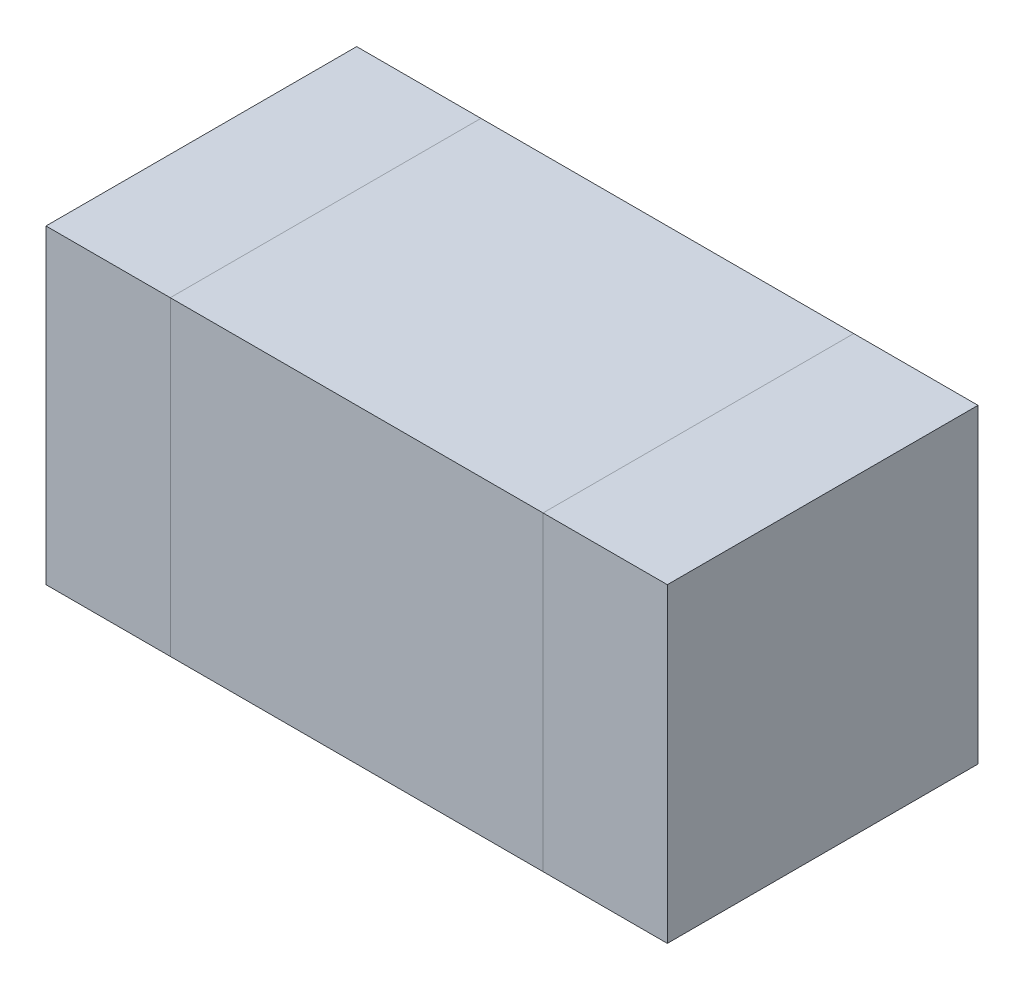
ISO-10303-21;
HEADER;
FILE_DESCRIPTION(('STEP AP214'),'2;1');
FILE_NAME('part.step','',(''),(''),'','','');
FILE_SCHEMA(('AUTOMOTIVE_DESIGN { 1 0 10303 214 1 1 1 1 }'));
ENDSEC;
DATA;
#1=APPLICATION_CONTEXT('core data for automotive mechanical design processes');
#2=APPLICATION_PROTOCOL_DEFINITION('international standard','automotive_design',2000,#1);
#3=PRODUCT_CONTEXT('',#1,'mechanical');
#4=PRODUCT('Part','Part','',(#3));
#5=PRODUCT_RELATED_PRODUCT_CATEGORY('part','',(#4));
#6=PRODUCT_DEFINITION_FORMATION('','',#4);
#7=PRODUCT_DEFINITION_CONTEXT('part definition',#1,'design');
#8=PRODUCT_DEFINITION('design','',#6,#7);
#9=PRODUCT_DEFINITION_SHAPE('','',#8);
#10=(LENGTH_UNIT() NAMED_UNIT(*) SI_UNIT(.MILLI.,.METRE.));
#11=(NAMED_UNIT(*) PLANE_ANGLE_UNIT() SI_UNIT($,.RADIAN.));
#12=(NAMED_UNIT(*) SI_UNIT($,.STERADIAN.) SOLID_ANGLE_UNIT());
#13=UNCERTAINTY_MEASURE_WITH_UNIT(LENGTH_MEASURE(1.E-05),#10,'distance_accuracy_value','');
#14=(GEOMETRIC_REPRESENTATION_CONTEXT(3) GLOBAL_UNCERTAINTY_ASSIGNED_CONTEXT((#13)) GLOBAL_UNIT_ASSIGNED_CONTEXT((#10,
#11,#12)) REPRESENTATION_CONTEXT('',''));
#15=CARTESIAN_POINT('',(0.,0.,0.));
#16=DIRECTION('',(0.,0.,1.));
#17=DIRECTION('',(1.,0.,0.));
#18=AXIS2_PLACEMENT_3D('',#15,#16,#17);
#19=CARTESIAN_POINT('',(-0.3,0.5,0.));
#20=DIRECTION('',(1.,0.,0.));
#21=DIRECTION('',(0.,0.,-1.));
#22=AXIS2_PLACEMENT_3D('',#19,#20,#21);
#23=PLANE('',#22);
#24=DIRECTION('',(0.,0.,1.));
#25=VECTOR('',#24,1.);
#26=CARTESIAN_POINT('',(-0.3,0.5,0.));
#27=LINE('',#26,#25);
#28=CARTESIAN_POINT('',(-0.3,0.5,0.25));
#29=VERTEX_POINT('',#28);
#30=CARTESIAN_POINT('',(-0.3,0.5,-0.25));
#31=VERTEX_POINT('',#30);
#32=EDGE_CURVE('P0_E58',#29,#31,#27,.F.);
#33=ORIENTED_EDGE('',*,*,#32,.F.);
#34=DIRECTION('',(0.,1.,0.));
#35=VECTOR('',#34,1.);
#36=CARTESIAN_POINT('',(-0.3,0.5,0.25));
#37=LINE('',#36,#35);
#38=CARTESIAN_POINT('',(-0.3,0.,0.25));
#39=VERTEX_POINT('',#38);
#40=EDGE_CURVE('P0_E52',#39,#29,#37,.T.);
#41=ORIENTED_EDGE('',*,*,#40,.F.);
#42=DIRECTION('',(0.,0.,1.));
#43=VECTOR('',#42,1.);
#44=CARTESIAN_POINT('',(-0.3,0.,0.));
#45=LINE('',#44,#43);
#46=CARTESIAN_POINT('',(-0.3,0.,-0.25));
#47=VERTEX_POINT('',#46);
#48=EDGE_CURVE('P0_E60',#39,#47,#45,.F.);
#49=ORIENTED_EDGE('',*,*,#48,.T.);
#50=DIRECTION('',(0.,1.,0.));
#51=VECTOR('',#50,1.);
#52=CARTESIAN_POINT('',(-0.3,0.5,-0.25));
#53=LINE('',#52,#51);
#54=EDGE_CURVE('P0_E19',#47,#31,#53,.T.);
#55=ORIENTED_EDGE('',*,*,#54,.T.);
#56=EDGE_LOOP('',(#33,#41,#49,#55));
#57=FACE_BOUND('',#56,.T.);
#58=ADVANCED_FACE('P0_F16',(#57),#23,.T.);
#59=CARTESIAN_POINT('',(0.,0.5,-0.25));
#60=DIRECTION('',(0.,0.,1.));
#61=DIRECTION('',(1.,0.,0.));
#62=AXIS2_PLACEMENT_3D('',#59,#60,#61);
#63=PLANE('',#62);
#64=DIRECTION('',(0.,1.,0.));
#65=VECTOR('',#64,1.);
#66=CARTESIAN_POINT('',(-0.5,0.5,-0.25));
#67=LINE('',#66,#65);
#68=CARTESIAN_POINT('',(-0.5,0.,-0.25));
#69=VERTEX_POINT('',#68);
#70=CARTESIAN_POINT('',(-0.5,0.5,-0.25));
#71=VERTEX_POINT('',#70);
#72=EDGE_CURVE('P0_E74',#69,#71,#67,.T.);
#73=ORIENTED_EDGE('',*,*,#72,.T.);
#74=DIRECTION('',(1.,0.,0.));
#75=VECTOR('',#74,1.);
#76=CARTESIAN_POINT('',(0.,0.5,-0.25));
#77=LINE('',#76,#75);
#78=EDGE_CURVE('P0_E65',#31,#71,#77,.F.);
#79=ORIENTED_EDGE('',*,*,#78,.F.);
#80=ORIENTED_EDGE('',*,*,#54,.F.);
#81=DIRECTION('',(1.,0.,0.));
#82=VECTOR('',#81,1.);
#83=CARTESIAN_POINT('',(0.,0.,-0.25));
#84=LINE('',#83,#82);
#85=EDGE_CURVE('P0_E80',#47,#69,#84,.F.);
#86=ORIENTED_EDGE('',*,*,#85,.T.);
#87=EDGE_LOOP('',(#73,#79,#80,#86));
#88=FACE_BOUND('',#87,.T.);
#89=ADVANCED_FACE('P0_F73',(#88),#63,.F.);
#90=CARTESIAN_POINT('',(0.,0.5,0.));
#91=DIRECTION('',(0.,1.,0.));
#92=DIRECTION('',(0.,0.,1.));
#93=AXIS2_PLACEMENT_3D('',#90,#91,#92);
#94=PLANE('',#93);
#95=DIRECTION('',(1.,0.,0.));
#96=VECTOR('',#95,1.);
#97=CARTESIAN_POINT('',(0.,0.5,0.25));
#98=LINE('',#97,#96);
#99=CARTESIAN_POINT('',(-0.5,0.5,0.25));
#100=VERTEX_POINT('',#99);
#101=EDGE_CURVE('P0_E70',#29,#100,#98,.F.);
#102=ORIENTED_EDGE('',*,*,#101,.F.);
#103=ORIENTED_EDGE('',*,*,#32,.T.);
#104=ORIENTED_EDGE('',*,*,#78,.T.);
#105=DIRECTION('',(0.,0.,-1.));
#106=VECTOR('',#105,1.);
#107=CARTESIAN_POINT('',(-0.5,0.5,0.));
#108=LINE('',#107,#106);
#109=EDGE_CURVE('P0_E83',#71,#100,#108,.F.);
#110=ORIENTED_EDGE('',*,*,#109,.T.);
#111=EDGE_LOOP('',(#102,#103,#104,#110));
#112=FACE_BOUND('',#111,.T.);
#113=ADVANCED_FACE('P0_F67',(#112),#94,.T.);
#114=CARTESIAN_POINT('',(0.,0.5,0.25));
#115=DIRECTION('',(0.,0.,1.));
#116=DIRECTION('',(1.,0.,0.));
#117=AXIS2_PLACEMENT_3D('',#114,#115,#116);
#118=PLANE('',#117);
#119=ORIENTED_EDGE('',*,*,#101,.T.);
#120=DIRECTION('',(0.,1.,0.));
#121=VECTOR('',#120,1.);
#122=CARTESIAN_POINT('',(-0.5,0.5,0.25));
#123=LINE('',#122,#121);
#124=CARTESIAN_POINT('',(-0.5,0.,0.25));
#125=VERTEX_POINT('',#124);
#126=EDGE_CURVE('P0_E25',#100,#125,#123,.F.);
#127=ORIENTED_EDGE('',*,*,#126,.T.);
#128=DIRECTION('',(1.,0.,0.));
#129=VECTOR('',#128,1.);
#130=CARTESIAN_POINT('',(0.,0.,0.25));
#131=LINE('',#130,#129);
#132=EDGE_CURVE('P0_E33',#125,#39,#131,.T.);
#133=ORIENTED_EDGE('',*,*,#132,.T.);
#134=ORIENTED_EDGE('',*,*,#40,.T.);
#135=EDGE_LOOP('',(#119,#127,#133,#134));
#136=FACE_BOUND('',#135,.T.);
#137=ADVANCED_FACE('P0_F87',(#136),#118,.T.);
#138=CARTESIAN_POINT('',(0.,0.,0.));
#139=DIRECTION('',(0.,1.,0.));
#140=DIRECTION('',(0.,0.,1.));
#141=AXIS2_PLACEMENT_3D('',#138,#139,#140);
#142=PLANE('',#141);
#143=ORIENTED_EDGE('',*,*,#48,.F.);
#144=ORIENTED_EDGE('',*,*,#132,.F.);
#145=DIRECTION('',(0.,0.,-1.));
#146=VECTOR('',#145,1.);
#147=CARTESIAN_POINT('',(-0.5,0.,0.));
#148=LINE('',#147,#146);
#149=EDGE_CURVE('P0_E11',#125,#69,#148,.T.);
#150=ORIENTED_EDGE('',*,*,#149,.T.);
#151=ORIENTED_EDGE('',*,*,#85,.F.);
#152=EDGE_LOOP('',(#143,#144,#150,#151));
#153=FACE_BOUND('',#152,.T.);
#154=ADVANCED_FACE('P0_F90',(#153),#142,.F.);
#155=CARTESIAN_POINT('',(-0.5,0.5,0.));
#156=DIRECTION('',(1.,0.,0.));
#157=DIRECTION('',(0.,0.,-1.));
#158=AXIS2_PLACEMENT_3D('',#155,#156,#157);
#159=PLANE('',#158);
#160=ORIENTED_EDGE('',*,*,#126,.F.);
#161=ORIENTED_EDGE('',*,*,#109,.F.);
#162=ORIENTED_EDGE('',*,*,#72,.F.);
#163=ORIENTED_EDGE('',*,*,#149,.F.);
#164=EDGE_LOOP('',(#160,#161,#162,#163));
#165=FACE_BOUND('',#164,.T.);
#166=ADVANCED_FACE('P0_F89',(#165),#159,.F.);
#167=CLOSED_SHELL('',(#58,#89,#113,#137,#154,#166));
#168=MANIFOLD_SOLID_BREP('P0_B1',#167);
#169=CARTESIAN_POINT('',(0.,0.5,-0.25));
#170=DIRECTION('',(0.,0.,-1.));
#171=DIRECTION('',(-1.,0.,0.));
#172=AXIS2_PLACEMENT_3D('',#169,#170,#171);
#173=PLANE('',#172);
#174=DIRECTION('',(1.,0.,0.));
#175=VECTOR('',#174,1.);
#176=CARTESIAN_POINT('',(0.,0.5,-0.25));
#177=LINE('',#176,#175);
#178=CARTESIAN_POINT('',(0.3,0.5,-0.25));
#179=VERTEX_POINT('',#178);
#180=CARTESIAN_POINT('',(-0.3,0.5,-0.25));
#181=VERTEX_POINT('',#180);
#182=EDGE_CURVE('P1_E57',#179,#181,#177,.F.);
#183=ORIENTED_EDGE('',*,*,#182,.F.);
#184=DIRECTION('',(0.,1.,0.));
#185=VECTOR('',#184,1.);
#186=CARTESIAN_POINT('',(0.3,0.5,-0.25));
#187=LINE('',#186,#185);
#188=CARTESIAN_POINT('',(0.3,0.,-0.25));
#189=VERTEX_POINT('',#188);
#190=EDGE_CURVE('P1_E52',#189,#179,#187,.T.);
#191=ORIENTED_EDGE('',*,*,#190,.F.);
#192=DIRECTION('',(1.,0.,0.));
#193=VECTOR('',#192,1.);
#194=CARTESIAN_POINT('',(0.,0.,-0.25));
#195=LINE('',#194,#193);
#196=CARTESIAN_POINT('',(-0.3,0.,-0.25));
#197=VERTEX_POINT('',#196);
#198=EDGE_CURVE('P1_E67',#189,#197,#195,.F.);
#199=ORIENTED_EDGE('',*,*,#198,.T.);
#200=DIRECTION('',(0.,1.,0.));
#201=VECTOR('',#200,1.);
#202=CARTESIAN_POINT('',(-0.3,0.5,-0.25));
#203=LINE('',#202,#201);
#204=EDGE_CURVE('P1_E19',#197,#181,#203,.T.);
#205=ORIENTED_EDGE('',*,*,#204,.T.);
#206=EDGE_LOOP('',(#183,#191,#199,#205));
#207=FACE_BOUND('',#206,.T.);
#208=ADVANCED_FACE('P1_F16',(#207),#173,.T.);
#209=CARTESIAN_POINT('',(-0.3,0.5,0.));
#210=DIRECTION('',(1.,0.,0.));
#211=DIRECTION('',(0.,0.,-1.));
#212=AXIS2_PLACEMENT_3D('',#209,#210,#211);
#213=PLANE('',#212);
#214=DIRECTION('',(0.,1.,0.));
#215=VECTOR('',#214,1.);
#216=CARTESIAN_POINT('',(-0.3,0.5,0.25));
#217=LINE('',#216,#215);
#218=CARTESIAN_POINT('',(-0.3,0.,0.25));
#219=VERTEX_POINT('',#218);
#220=CARTESIAN_POINT('',(-0.3,0.5,0.25));
#221=VERTEX_POINT('',#220);
#222=EDGE_CURVE('P1_E73',#219,#221,#217,.T.);
#223=ORIENTED_EDGE('',*,*,#222,.T.);
#224=DIRECTION('',(0.,0.,1.));
#225=VECTOR('',#224,1.);
#226=CARTESIAN_POINT('',(-0.3,0.5,0.));
#227=LINE('',#226,#225);
#228=EDGE_CURVE('P1_E62',#181,#221,#227,.T.);
#229=ORIENTED_EDGE('',*,*,#228,.F.);
#230=ORIENTED_EDGE('',*,*,#204,.F.);
#231=DIRECTION('',(0.,0.,1.));
#232=VECTOR('',#231,1.);
#233=CARTESIAN_POINT('',(-0.3,0.,0.));
#234=LINE('',#233,#232);
#235=EDGE_CURVE('P1_E80',#197,#219,#234,.T.);
#236=ORIENTED_EDGE('',*,*,#235,.T.);
#237=EDGE_LOOP('',(#223,#229,#230,#236));
#238=FACE_BOUND('',#237,.T.);
#239=ADVANCED_FACE('P1_F72',(#238),#213,.F.);
#240=CARTESIAN_POINT('',(0.,0.5,0.));
#241=DIRECTION('',(0.,1.,0.));
#242=DIRECTION('',(0.,0.,1.));
#243=AXIS2_PLACEMENT_3D('',#240,#241,#242);
#244=PLANE('',#243);
#245=ORIENTED_EDGE('',*,*,#182,.T.);
#246=ORIENTED_EDGE('',*,*,#228,.T.);
#247=DIRECTION('',(-1.,0.,0.));
#248=VECTOR('',#247,1.);
#249=CARTESIAN_POINT('',(0.,0.5,0.25));
#250=LINE('',#249,#248);
#251=CARTESIAN_POINT('',(0.3,0.5,0.25));
#252=VERTEX_POINT('',#251);
#253=EDGE_CURVE('P1_E83',#221,#252,#250,.F.);
#254=ORIENTED_EDGE('',*,*,#253,.T.);
#255=DIRECTION('',(0.,0.,-1.));
#256=VECTOR('',#255,1.);
#257=CARTESIAN_POINT('',(0.3,0.5,0.));
#258=LINE('',#257,#256);
#259=EDGE_CURVE('P1_E64',#179,#252,#258,.F.);
#260=ORIENTED_EDGE('',*,*,#259,.F.);
#261=EDGE_LOOP('',(#245,#246,#254,#260));
#262=FACE_BOUND('',#261,.T.);
#263=ADVANCED_FACE('P1_F59',(#262),#244,.T.);
#264=CARTESIAN_POINT('',(0.3,0.5,0.));
#265=DIRECTION('',(1.,0.,0.));
#266=DIRECTION('',(0.,0.,-1.));
#267=AXIS2_PLACEMENT_3D('',#264,#265,#266);
#268=PLANE('',#267);
#269=ORIENTED_EDGE('',*,*,#259,.T.);
#270=DIRECTION('',(0.,1.,0.));
#271=VECTOR('',#270,1.);
#272=CARTESIAN_POINT('',(0.3,0.5,0.25));
#273=LINE('',#272,#271);
#274=CARTESIAN_POINT('',(0.3,0.,0.25));
#275=VERTEX_POINT('',#274);
#276=EDGE_CURVE('P1_E25',#252,#275,#273,.F.);
#277=ORIENTED_EDGE('',*,*,#276,.T.);
#278=DIRECTION('',(0.,0.,1.));
#279=VECTOR('',#278,1.);
#280=CARTESIAN_POINT('',(0.3,0.,0.));
#281=LINE('',#280,#279);
#282=EDGE_CURVE('P1_E33',#275,#189,#281,.F.);
#283=ORIENTED_EDGE('',*,*,#282,.T.);
#284=ORIENTED_EDGE('',*,*,#190,.T.);
#285=EDGE_LOOP('',(#269,#277,#283,#284));
#286=FACE_BOUND('',#285,.T.);
#287=ADVANCED_FACE('P1_F87',(#286),#268,.T.);
#288=CARTESIAN_POINT('',(0.,0.,0.));
#289=DIRECTION('',(0.,1.,0.));
#290=DIRECTION('',(0.,0.,1.));
#291=AXIS2_PLACEMENT_3D('',#288,#289,#290);
#292=PLANE('',#291);
#293=ORIENTED_EDGE('',*,*,#235,.F.);
#294=ORIENTED_EDGE('',*,*,#198,.F.);
#295=ORIENTED_EDGE('',*,*,#282,.F.);
#296=DIRECTION('',(-1.,0.,0.));
#297=VECTOR('',#296,1.);
#298=CARTESIAN_POINT('',(0.,0.,0.25));
#299=LINE('',#298,#297);
#300=EDGE_CURVE('P1_E11',#275,#219,#299,.T.);
#301=ORIENTED_EDGE('',*,*,#300,.T.);
#302=EDGE_LOOP('',(#293,#294,#295,#301));
#303=FACE_BOUND('',#302,.T.);
#304=ADVANCED_FACE('P1_F90',(#303),#292,.F.);
#305=CARTESIAN_POINT('',(0.,0.5,0.25));
#306=DIRECTION('',(0.,0.,-1.));
#307=DIRECTION('',(-1.,0.,0.));
#308=AXIS2_PLACEMENT_3D('',#305,#306,#307);
#309=PLANE('',#308);
#310=ORIENTED_EDGE('',*,*,#276,.F.);
#311=ORIENTED_EDGE('',*,*,#253,.F.);
#312=ORIENTED_EDGE('',*,*,#222,.F.);
#313=ORIENTED_EDGE('',*,*,#300,.F.);
#314=EDGE_LOOP('',(#310,#311,#312,#313));
#315=FACE_BOUND('',#314,.T.);
#316=ADVANCED_FACE('P1_F89',(#315),#309,.F.);
#317=CLOSED_SHELL('',(#208,#239,#263,#287,#304,#316));
#318=MANIFOLD_SOLID_BREP('P1_B1',#317);
#319=CARTESIAN_POINT('',(0.3,0.5,0.));
#320=DIRECTION('',(1.,0.,0.));
#321=DIRECTION('',(0.,0.,-1.));
#322=AXIS2_PLACEMENT_3D('',#319,#320,#321);
#323=PLANE('',#322);
#324=DIRECTION('',(0.,1.,0.));
#325=VECTOR('',#324,1.);
#326=CARTESIAN_POINT('',(0.3,0.5,0.25));
#327=LINE('',#326,#325);
#328=CARTESIAN_POINT('',(0.3,0.,0.25));
#329=VERTEX_POINT('',#328);
#330=CARTESIAN_POINT('',(0.3,0.5,0.25));
#331=VERTEX_POINT('',#330);
#332=EDGE_CURVE('P2_E78',#329,#331,#327,.T.);
#333=ORIENTED_EDGE('',*,*,#332,.T.);
#334=DIRECTION('',(0.,0.,1.));
#335=VECTOR('',#334,1.);
#336=CARTESIAN_POINT('',(0.3,0.5,0.));
#337=LINE('',#336,#335);
#338=CARTESIAN_POINT('',(0.3,0.5,-0.25));
#339=VERTEX_POINT('',#338);
#340=EDGE_CURVE('P2_E67',#339,#331,#337,.T.);
#341=ORIENTED_EDGE('',*,*,#340,.F.);
#342=DIRECTION('',(0.,1.,0.));
#343=VECTOR('',#342,1.);
#344=CARTESIAN_POINT('',(0.3,0.5,-0.25));
#345=LINE('',#344,#343);
#346=CARTESIAN_POINT('',(0.3,0.,-0.25));
#347=VERTEX_POINT('',#346);
#348=EDGE_CURVE('P2_E55',#347,#339,#345,.T.);
#349=ORIENTED_EDGE('',*,*,#348,.F.);
#350=DIRECTION('',(0.,0.,1.));
#351=VECTOR('',#350,1.);
#352=CARTESIAN_POINT('',(0.3,0.,0.));
#353=LINE('',#352,#351);
#354=EDGE_CURVE('P2_E19',#347,#329,#353,.T.);
#355=ORIENTED_EDGE('',*,*,#354,.T.);
#356=EDGE_LOOP('',(#333,#341,#349,#355));
#357=FACE_BOUND('',#356,.T.);
#358=ADVANCED_FACE('P2_F16',(#357),#323,.F.);
#359=CARTESIAN_POINT('',(0.,0.,0.));
#360=DIRECTION('',(0.,1.,0.));
#361=DIRECTION('',(0.,0.,1.));
#362=AXIS2_PLACEMENT_3D('',#359,#360,#361);
#363=PLANE('',#362);
#364=DIRECTION('',(-1.,0.,0.));
#365=VECTOR('',#364,1.);
#366=CARTESIAN_POINT('',(0.,0.,0.25));
#367=LINE('',#366,#365);
#368=CARTESIAN_POINT('',(0.5,0.,0.25));
#369=VERTEX_POINT('',#368);
#370=EDGE_CURVE('P2_E64',#369,#329,#367,.T.);
#371=ORIENTED_EDGE('',*,*,#370,.T.);
#372=ORIENTED_EDGE('',*,*,#354,.F.);
#373=DIRECTION('',(-1.,0.,0.));
#374=VECTOR('',#373,1.);
#375=CARTESIAN_POINT('',(0.,0.,-0.25));
#376=LINE('',#375,#374);
#377=CARTESIAN_POINT('',(0.5,0.,-0.25));
#378=VERTEX_POINT('',#377);
#379=EDGE_CURVE('P2_E61',#378,#347,#376,.T.);
#380=ORIENTED_EDGE('',*,*,#379,.F.);
#381=DIRECTION('',(0.,0.,-1.));
#382=VECTOR('',#381,1.);
#383=CARTESIAN_POINT('',(0.5,0.,0.));
#384=LINE('',#383,#382);
#385=EDGE_CURVE('P2_E82',#369,#378,#384,.T.);
#386=ORIENTED_EDGE('',*,*,#385,.F.);
#387=EDGE_LOOP('',(#371,#372,#380,#386));
#388=FACE_BOUND('',#387,.T.);
#389=ADVANCED_FACE('P2_F60',(#388),#363,.F.);
#390=CARTESIAN_POINT('',(0.,0.5,-0.25));
#391=DIRECTION('',(0.,0.,-1.));
#392=DIRECTION('',(-1.,0.,0.));
#393=AXIS2_PLACEMENT_3D('',#390,#391,#392);
#394=PLANE('',#393);
#395=DIRECTION('',(1.,0.,0.));
#396=VECTOR('',#395,1.);
#397=CARTESIAN_POINT('',(0.,0.5,-0.25));
#398=LINE('',#397,#396);
#399=CARTESIAN_POINT('',(0.5,0.5,-0.25));
#400=VERTEX_POINT('',#399);
#401=EDGE_CURVE('P2_E69',#400,#339,#398,.F.);
#402=ORIENTED_EDGE('',*,*,#401,.F.);
#403=DIRECTION('',(0.,1.,0.));
#404=VECTOR('',#403,1.);
#405=CARTESIAN_POINT('',(0.5,0.5,-0.25));
#406=LINE('',#405,#404);
#407=EDGE_CURVE('P2_E73',#378,#400,#406,.T.);
#408=ORIENTED_EDGE('',*,*,#407,.F.);
#409=ORIENTED_EDGE('',*,*,#379,.T.);
#410=ORIENTED_EDGE('',*,*,#348,.T.);
#411=EDGE_LOOP('',(#402,#408,#409,#410));
#412=FACE_BOUND('',#411,.T.);
#413=ADVANCED_FACE('P2_F71',(#412),#394,.T.);
#414=CARTESIAN_POINT('',(0.,0.5,0.));
#415=DIRECTION('',(0.,1.,0.));
#416=DIRECTION('',(0.,0.,1.));
#417=AXIS2_PLACEMENT_3D('',#414,#415,#416);
#418=PLANE('',#417);
#419=ORIENTED_EDGE('',*,*,#340,.T.);
#420=DIRECTION('',(-1.,0.,0.));
#421=VECTOR('',#420,1.);
#422=CARTESIAN_POINT('',(0.,0.5,0.25));
#423=LINE('',#422,#421);
#424=CARTESIAN_POINT('',(0.5,0.5,0.25));
#425=VERTEX_POINT('',#424);
#426=EDGE_CURVE('P2_E34',#331,#425,#423,.F.);
#427=ORIENTED_EDGE('',*,*,#426,.T.);
#428=DIRECTION('',(0.,0.,-1.));
#429=VECTOR('',#428,1.);
#430=CARTESIAN_POINT('',(0.5,0.5,0.));
#431=LINE('',#430,#429);
#432=EDGE_CURVE('P2_E25',#400,#425,#431,.F.);
#433=ORIENTED_EDGE('',*,*,#432,.F.);
#434=ORIENTED_EDGE('',*,*,#401,.T.);
#435=EDGE_LOOP('',(#419,#427,#433,#434));
#436=FACE_BOUND('',#435,.T.);
#437=ADVANCED_FACE('P2_F88',(#436),#418,.T.);
#438=CARTESIAN_POINT('',(0.,0.5,0.25));
#439=DIRECTION('',(0.,0.,-1.));
#440=DIRECTION('',(-1.,0.,0.));
#441=AXIS2_PLACEMENT_3D('',#438,#439,#440);
#442=PLANE('',#441);
#443=DIRECTION('',(0.,1.,0.));
#444=VECTOR('',#443,1.);
#445=CARTESIAN_POINT('',(0.5,0.5,0.25));
#446=LINE('',#445,#444);
#447=EDGE_CURVE('P2_E11',#425,#369,#446,.F.);
#448=ORIENTED_EDGE('',*,*,#447,.F.);
#449=ORIENTED_EDGE('',*,*,#426,.F.);
#450=ORIENTED_EDGE('',*,*,#332,.F.);
#451=ORIENTED_EDGE('',*,*,#370,.F.);
#452=EDGE_LOOP('',(#448,#449,#450,#451));
#453=FACE_BOUND('',#452,.T.);
#454=ADVANCED_FACE('P2_F90',(#453),#442,.F.);
#455=CARTESIAN_POINT('',(0.5,0.5,0.));
#456=DIRECTION('',(1.,0.,0.));
#457=DIRECTION('',(0.,0.,-1.));
#458=AXIS2_PLACEMENT_3D('',#455,#456,#457);
#459=PLANE('',#458);
#460=ORIENTED_EDGE('',*,*,#432,.T.);
#461=ORIENTED_EDGE('',*,*,#447,.T.);
#462=ORIENTED_EDGE('',*,*,#385,.T.);
#463=ORIENTED_EDGE('',*,*,#407,.T.);
#464=EDGE_LOOP('',(#460,#461,#462,#463));
#465=FACE_BOUND('',#464,.T.);
#466=ADVANCED_FACE('P2_F87',(#465),#459,.T.);
#467=CLOSED_SHELL('',(#358,#389,#413,#437,#454,#466));
#468=MANIFOLD_SOLID_BREP('P2_B1',#467);
#469=ADVANCED_BREP_SHAPE_REPRESENTATION('',(#18,#168,#318,#468),#14);
#470=SHAPE_DEFINITION_REPRESENTATION(#9,#469);
ENDSEC;
END-ISO-10303-21;
